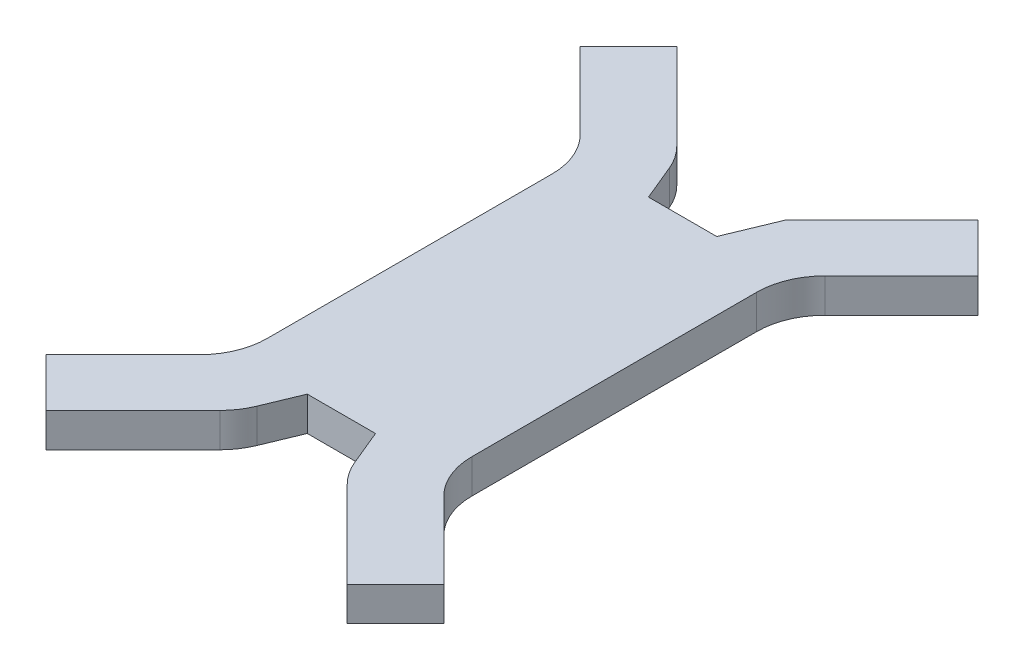
ISO-10303-21;
HEADER;
FILE_DESCRIPTION(('STEP AP214'),'2;1');
FILE_NAME('part.step','',(''),(''),'','','');
FILE_SCHEMA(('AUTOMOTIVE_DESIGN { 1 0 10303 214 1 1 1 1 }'));
ENDSEC;
DATA;
#1=APPLICATION_CONTEXT('core data for automotive mechanical design processes');
#2=APPLICATION_PROTOCOL_DEFINITION('international standard','automotive_design',2000,#1);
#3=PRODUCT_CONTEXT('',#1,'mechanical');
#4=PRODUCT('Part','Part','',(#3));
#5=PRODUCT_RELATED_PRODUCT_CATEGORY('part','',(#4));
#6=PRODUCT_DEFINITION_FORMATION('','',#4);
#7=PRODUCT_DEFINITION_CONTEXT('part definition',#1,'design');
#8=PRODUCT_DEFINITION('design','',#6,#7);
#9=PRODUCT_DEFINITION_SHAPE('','',#8);
#10=(LENGTH_UNIT() NAMED_UNIT(*) SI_UNIT(.MILLI.,.METRE.));
#11=(NAMED_UNIT(*) PLANE_ANGLE_UNIT() SI_UNIT($,.RADIAN.));
#12=(NAMED_UNIT(*) SI_UNIT($,.STERADIAN.) SOLID_ANGLE_UNIT());
#13=UNCERTAINTY_MEASURE_WITH_UNIT(LENGTH_MEASURE(1.E-05),#10,'distance_accuracy_value','');
#14=(GEOMETRIC_REPRESENTATION_CONTEXT(3) GLOBAL_UNCERTAINTY_ASSIGNED_CONTEXT((#13)) GLOBAL_UNIT_ASSIGNED_CONTEXT((#10,
#11,#12)) REPRESENTATION_CONTEXT('',''));
#15=CARTESIAN_POINT('',(0.,0.,0.));
#16=DIRECTION('',(0.,0.,1.));
#17=DIRECTION('',(1.,0.,0.));
#18=AXIS2_PLACEMENT_3D('',#15,#16,#17);
#19=CARTESIAN_POINT('',(-65.6077229732291,5.,-30.5840513108286));
#20=DIRECTION('',(0.707106781186548,0.,-0.707106781186548));
#21=DIRECTION('',(-0.707106781186548,0.,-0.707106781186548));
#22=AXIS2_PLACEMENT_3D('',#19,#20,#21);
#23=PLANE('',#22);
#24=DIRECTION('',(0.707106781186548,0.,0.707106781186548));
#25=VECTOR('',#24,1.);
#26=CARTESIAN_POINT('',(-65.6077229732291,0.,-30.5840513108286));
#27=LINE('',#26,#25);
#28=CARTESIAN_POINT('',(-65.6077229732291,0.,-30.5840513108286));
#29=VERTEX_POINT('',#28);
#30=CARTESIAN_POINT('',(-54.3945195376327,0.,-19.3708478752322));
#31=VERTEX_POINT('',#30);
#32=EDGE_CURVE('E243',#29,#31,#27,.T.);
#33=ORIENTED_EDGE('',*,*,#32,.T.);
#34=DIRECTION('',(0.,-1.,0.));
#35=VECTOR('',#34,1.);
#36=CARTESIAN_POINT('',(-54.3945195376327,5.,-19.3708478752322));
#37=LINE('',#36,#35);
#38=CARTESIAN_POINT('',(-54.3945195376327,5.,-19.3708478752322));
#39=VERTEX_POINT('',#38);
#40=EDGE_CURVE('E11',#39,#31,#37,.T.);
#41=ORIENTED_EDGE('',*,*,#40,.F.);
#42=DIRECTION('',(0.707106781186548,0.,0.707106781186548));
#43=VECTOR('',#42,1.);
#44=CARTESIAN_POINT('',(-65.6077229732291,5.,-30.5840513108286));
#45=LINE('',#44,#43);
#46=CARTESIAN_POINT('',(-65.6077229732291,5.,-30.5840513108286));
#47=VERTEX_POINT('',#46);
#48=EDGE_CURVE('E295',#47,#39,#45,.T.);
#49=ORIENTED_EDGE('',*,*,#48,.F.);
#50=DIRECTION('',(0.,-1.,0.));
#51=VECTOR('',#50,1.);
#52=CARTESIAN_POINT('',(-65.6077229732291,5.,-30.5840513108286));
#53=LINE('',#52,#51);
#54=EDGE_CURVE('E239',#47,#29,#53,.T.);
#55=ORIENTED_EDGE('',*,*,#54,.T.);
#56=EDGE_LOOP('',(#33,#41,#49,#55));
#57=FACE_BOUND('',#56,.T.);
#58=ADVANCED_FACE('F33',(#57),#23,.F.);
#59=CARTESIAN_POINT('',(-61.4655873494982,5.,-12.2997800633667));
#60=DIRECTION('',(0.,-1.,0.));
#61=DIRECTION('',(0.,0.,-1.));
#62=AXIS2_PLACEMENT_3D('',#59,#60,#61);
#63=CYLINDRICAL_SURFACE('',#62,10.);
#64=CARTESIAN_POINT('',(-61.4655873494982,0.,-12.2997800633667));
#65=DIRECTION('',(0.,-1.,0.));
#66=DIRECTION('',(0.,0.,-1.));
#67=AXIS2_PLACEMENT_3D('',#64,#65,#66);
#68=CIRCLE('',#67,10.);
#69=CARTESIAN_POINT('',(-51.4655873494982,0.,-12.2997800633667));
#70=VERTEX_POINT('',#69);
#71=EDGE_CURVE('E246',#31,#70,#68,.T.);
#72=ORIENTED_EDGE('',*,*,#71,.T.);
#73=DIRECTION('',(0.,-1.,0.));
#74=VECTOR('',#73,1.);
#75=CARTESIAN_POINT('',(-51.4655873494982,5.,-12.2997800633667));
#76=LINE('',#75,#74);
#77=CARTESIAN_POINT('',(-51.4655873494982,5.,-12.2997800633667));
#78=VERTEX_POINT('',#77);
#79=EDGE_CURVE('E41',#78,#70,#76,.T.);
#80=ORIENTED_EDGE('',*,*,#79,.F.);
#81=CARTESIAN_POINT('',(-61.4655873494982,5.,-12.2997800633667));
#82=DIRECTION('',(0.,-1.,0.));
#83=DIRECTION('',(0.,0.,-1.));
#84=AXIS2_PLACEMENT_3D('',#81,#82,#83);
#85=CIRCLE('',#84,10.);
#86=EDGE_CURVE('E149',#39,#78,#85,.T.);
#87=ORIENTED_EDGE('',*,*,#86,.F.);
#88=ORIENTED_EDGE('',*,*,#40,.T.);
#89=EDGE_LOOP('',(#72,#80,#87,#88));
#90=FACE_BOUND('',#89,.T.);
#91=ADVANCED_FACE('F448',(#90),#63,.F.);
#92=CARTESIAN_POINT('',(-51.4655873494982,5.,-12.2997800633667));
#93=DIRECTION('',(1.,0.,0.));
#94=DIRECTION('',(0.,0.,-1.));
#95=AXIS2_PLACEMENT_3D('',#92,#93,#94);
#96=PLANE('',#95);
#97=DIRECTION('',(0.,0.,1.));
#98=VECTOR('',#97,1.);
#99=CARTESIAN_POINT('',(-51.4655873494982,0.,-12.2997800633667));
#100=LINE('',#99,#98);
#101=CARTESIAN_POINT('',(-51.4655873494982,0.,29.4159486891714));
#102=VERTEX_POINT('',#101);
#103=EDGE_CURVE('E248',#70,#102,#100,.T.);
#104=ORIENTED_EDGE('',*,*,#103,.T.);
#105=DIRECTION('',(0.,-1.,0.));
#106=VECTOR('',#105,1.);
#107=CARTESIAN_POINT('',(-51.4655873494982,5.,29.4159486891714));
#108=LINE('',#107,#106);
#109=CARTESIAN_POINT('',(-51.4655873494982,5.,29.4159486891714));
#110=VERTEX_POINT('',#109);
#111=EDGE_CURVE('E359',#110,#102,#108,.T.);
#112=ORIENTED_EDGE('',*,*,#111,.F.);
#113=DIRECTION('',(0.,0.,1.));
#114=VECTOR('',#113,1.);
#115=CARTESIAN_POINT('',(-51.4655873494982,5.,-12.2997800633667));
#116=LINE('',#115,#114);
#117=EDGE_CURVE('E367',#78,#110,#116,.T.);
#118=ORIENTED_EDGE('',*,*,#117,.F.);
#119=ORIENTED_EDGE('',*,*,#79,.T.);
#120=EDGE_LOOP('',(#104,#112,#118,#119));
#121=FACE_BOUND('',#120,.T.);
#122=ADVANCED_FACE('F365',(#121),#96,.F.);
#123=CARTESIAN_POINT('',(-61.4655873494982,5.,29.4159486891714));
#124=DIRECTION('',(0.,-1.,0.));
#125=DIRECTION('',(0.,0.,-1.));
#126=AXIS2_PLACEMENT_3D('',#123,#124,#125);
#127=CYLINDRICAL_SURFACE('',#126,10.);
#128=CARTESIAN_POINT('',(-61.4655873494982,0.,29.4159486891714));
#129=DIRECTION('',(0.,-1.,0.));
#130=DIRECTION('',(0.,0.,-1.));
#131=AXIS2_PLACEMENT_3D('',#128,#129,#130);
#132=CIRCLE('',#131,10.);
#133=CARTESIAN_POINT('',(-54.3945195376327,0.,36.4870165010369));
#134=VERTEX_POINT('',#133);
#135=EDGE_CURVE('E250',#102,#134,#132,.T.);
#136=ORIENTED_EDGE('',*,*,#135,.T.);
#137=DIRECTION('',(0.,-1.,0.));
#138=VECTOR('',#137,1.);
#139=CARTESIAN_POINT('',(-54.3945195376327,5.,36.4870165010369));
#140=LINE('',#139,#138);
#141=CARTESIAN_POINT('',(-54.3945195376327,5.,36.4870165010369));
#142=VERTEX_POINT('',#141);
#143=EDGE_CURVE('E356',#142,#134,#140,.T.);
#144=ORIENTED_EDGE('',*,*,#143,.F.);
#145=CARTESIAN_POINT('',(-61.4655873494982,5.,29.4159486891714));
#146=DIRECTION('',(0.,-1.,0.));
#147=DIRECTION('',(0.,0.,-1.));
#148=AXIS2_PLACEMENT_3D('',#145,#146,#147);
#149=CIRCLE('',#148,10.);
#150=EDGE_CURVE('E385',#110,#142,#149,.T.);
#151=ORIENTED_EDGE('',*,*,#150,.F.);
#152=ORIENTED_EDGE('',*,*,#111,.T.);
#153=EDGE_LOOP('',(#136,#144,#151,#152));
#154=FACE_BOUND('',#153,.T.);
#155=ADVANCED_FACE('F376',(#154),#127,.F.);
#156=CARTESIAN_POINT('',(-54.3945195376327,5.,36.4870165010369));
#157=DIRECTION('',(0.707106781186547,0.,0.707106781186548));
#158=DIRECTION('',(0.707106781186548,0.,-0.707106781186547));
#159=AXIS2_PLACEMENT_3D('',#156,#157,#158);
#160=PLANE('',#159);
#161=DIRECTION('',(-0.707106781186548,0.,0.707106781186547));
#162=VECTOR('',#161,1.);
#163=CARTESIAN_POINT('',(-54.3945195376327,0.,36.4870165010369));
#164=LINE('',#163,#162);
#165=CARTESIAN_POINT('',(-65.6077229732291,0.,47.7002199366333));
#166=VERTEX_POINT('',#165);
#167=EDGE_CURVE('E252',#134,#166,#164,.T.);
#168=ORIENTED_EDGE('',*,*,#167,.T.);
#169=DIRECTION('',(0.,-1.,0.));
#170=VECTOR('',#169,1.);
#171=CARTESIAN_POINT('',(-65.6077229732291,5.,47.7002199366333));
#172=LINE('',#171,#170);
#173=CARTESIAN_POINT('',(-65.6077229732291,5.,47.7002199366333));
#174=VERTEX_POINT('',#173);
#175=EDGE_CURVE('E353',#174,#166,#172,.T.);
#176=ORIENTED_EDGE('',*,*,#175,.F.);
#177=DIRECTION('',(-0.707106781186548,0.,0.707106781186547));
#178=VECTOR('',#177,1.);
#179=CARTESIAN_POINT('',(-54.3945195376327,5.,36.4870165010369));
#180=LINE('',#179,#178);
#181=EDGE_CURVE('E382',#142,#174,#180,.T.);
#182=ORIENTED_EDGE('',*,*,#181,.F.);
#183=ORIENTED_EDGE('',*,*,#143,.T.);
#184=EDGE_LOOP('',(#168,#176,#182,#183));
#185=FACE_BOUND('',#184,.T.);
#186=ADVANCED_FACE('F380',(#185),#160,.F.);
#187=CARTESIAN_POINT('',(-65.6077229732291,5.,47.7002199366333));
#188=DIRECTION('',(0.707106781186548,0.,-0.707106781186548));
#189=DIRECTION('',(-0.707106781186548,0.,-0.707106781186548));
#190=AXIS2_PLACEMENT_3D('',#187,#188,#189);
#191=PLANE('',#190);
#192=DIRECTION('',(0.707106781186547,0.,0.707106781186547));
#193=VECTOR('',#192,1.);
#194=CARTESIAN_POINT('',(-65.6077229732291,0.,47.7002199366333));
#195=LINE('',#194,#193);
#196=CARTESIAN_POINT('',(-58.5366551613636,0.,54.7712877484988));
#197=VERTEX_POINT('',#196);
#198=EDGE_CURVE('E254',#166,#197,#195,.T.);
#199=ORIENTED_EDGE('',*,*,#198,.T.);
#200=DIRECTION('',(0.,-1.,0.));
#201=VECTOR('',#200,1.);
#202=CARTESIAN_POINT('',(-58.5366551613636,5.,54.7712877484988));
#203=LINE('',#202,#201);
#204=CARTESIAN_POINT('',(-58.5366551613636,5.,54.7712877484988));
#205=VERTEX_POINT('',#204);
#206=EDGE_CURVE('E350',#205,#197,#203,.T.);
#207=ORIENTED_EDGE('',*,*,#206,.F.);
#208=DIRECTION('',(0.707106781186547,0.,0.707106781186547));
#209=VECTOR('',#208,1.);
#210=CARTESIAN_POINT('',(-65.6077229732291,5.,47.7002199366333));
#211=LINE('',#210,#209);
#212=EDGE_CURVE('E384',#174,#205,#211,.T.);
#213=ORIENTED_EDGE('',*,*,#212,.F.);
#214=ORIENTED_EDGE('',*,*,#175,.T.);
#215=EDGE_LOOP('',(#199,#207,#213,#214));
#216=FACE_BOUND('',#215,.T.);
#217=ADVANCED_FACE('F461',(#216),#191,.F.);
#218=CARTESIAN_POINT('',(-58.5366551613636,5.,54.7712877484988));
#219=DIRECTION('',(-0.707106781186548,0.,-0.707106781186548));
#220=DIRECTION('',(-0.707106781186548,0.,0.707106781186548));
#221=AXIS2_PLACEMENT_3D('',#218,#219,#220);
#222=PLANE('',#221);
#223=DIRECTION('',(0.707106781186548,0.,-0.707106781186548));
#224=VECTOR('',#223,1.);
#225=CARTESIAN_POINT('',(-58.5366551613636,0.,54.7712877484988));
#226=LINE('',#225,#224);
#227=CARTESIAN_POINT('',(-45.801042375993,0.,42.0356749631281));
#228=VERTEX_POINT('',#227);
#229=EDGE_CURVE('E256',#197,#228,#226,.T.);
#230=ORIENTED_EDGE('',*,*,#229,.T.);
#231=DIRECTION('',(0.,-1.,0.));
#232=VECTOR('',#231,1.);
#233=CARTESIAN_POINT('',(-45.801042375993,5.,42.0356749631281));
#234=LINE('',#233,#232);
#235=CARTESIAN_POINT('',(-45.801042375993,5.,42.0356749631281));
#236=VERTEX_POINT('',#235);
#237=EDGE_CURVE('E347',#236,#228,#234,.T.);
#238=ORIENTED_EDGE('',*,*,#237,.F.);
#239=DIRECTION('',(0.707106781186548,0.,-0.707106781186548));
#240=VECTOR('',#239,1.);
#241=CARTESIAN_POINT('',(-58.5366551613636,5.,54.7712877484988));
#242=LINE('',#241,#240);
#243=EDGE_CURVE('E387',#205,#236,#242,.T.);
#244=ORIENTED_EDGE('',*,*,#243,.F.);
#245=ORIENTED_EDGE('',*,*,#206,.T.);
#246=EDGE_LOOP('',(#230,#238,#244,#245));
#247=FACE_BOUND('',#246,.T.);
#248=ADVANCED_FACE('F464',(#247),#222,.F.);
#249=CARTESIAN_POINT('',(-52.8721101878584,5.,34.9646071512626));
#250=DIRECTION('',(0.,-1.,0.));
#251=DIRECTION('',(0.,0.,-1.));
#252=AXIS2_PLACEMENT_3D('',#249,#250,#251);
#253=CYLINDRICAL_SURFACE('',#252,10.);
#254=CARTESIAN_POINT('',(-52.8721101878584,0.,34.9646071512626));
#255=DIRECTION('',(0.,1.,0.));
#256=DIRECTION('',(0.,0.,1.));
#257=AXIS2_PLACEMENT_3D('',#254,#255,#256);
#258=CIRCLE('',#257,10.);
#259=CARTESIAN_POINT('',(-43.6333148627455,0.,38.7914414749135));
#260=VERTEX_POINT('',#259);
#261=EDGE_CURVE('E258',#228,#260,#258,.T.);
#262=ORIENTED_EDGE('',*,*,#261,.T.);
#263=DIRECTION('',(0.,-1.,0.));
#264=VECTOR('',#263,1.);
#265=CARTESIAN_POINT('',(-43.6333148627455,5.,38.7914414749135));
#266=LINE('',#265,#264);
#267=CARTESIAN_POINT('',(-43.6333148627455,5.,38.7914414749135));
#268=VERTEX_POINT('',#267);
#269=EDGE_CURVE('E344',#268,#260,#266,.T.);
#270=ORIENTED_EDGE('',*,*,#269,.F.);
#271=CARTESIAN_POINT('',(-52.8721101878584,5.,34.9646071512626));
#272=DIRECTION('',(0.,1.,0.));
#273=DIRECTION('',(0.,0.,1.));
#274=AXIS2_PLACEMENT_3D('',#271,#272,#273);
#275=CIRCLE('',#274,10.);
#276=EDGE_CURVE('E393',#236,#268,#275,.T.);
#277=ORIENTED_EDGE('',*,*,#276,.F.);
#278=ORIENTED_EDGE('',*,*,#237,.T.);
#279=EDGE_LOOP('',(#262,#270,#277,#278));
#280=FACE_BOUND('',#279,.T.);
#281=ADVANCED_FACE('F468',(#280),#253,.T.);
#282=CARTESIAN_POINT('',(-41.4655873494982,5.,33.5580843129024));
#283=DIRECTION('',(-0.923879532511287,0.,-0.382683432365089));
#284=DIRECTION('',(-0.382683432365089,0.,0.923879532511287));
#285=AXIS2_PLACEMENT_3D('',#282,#283,#284);
#286=PLANE('',#285);
#287=DIRECTION('',(0.382683432365089,0.,-0.923879532511287));
#288=VECTOR('',#287,1.);
#289=CARTESIAN_POINT('',(-41.4655873494982,0.,33.5580843129024));
#290=LINE('',#289,#288);
#291=CARTESIAN_POINT('',(-41.4655873494982,0.,33.5580843129024));
#292=VERTEX_POINT('',#291);
#293=EDGE_CURVE('E260',#260,#292,#290,.T.);
#294=ORIENTED_EDGE('',*,*,#293,.T.);
#295=DIRECTION('',(0.,-1.,0.));
#296=VECTOR('',#295,1.);
#297=CARTESIAN_POINT('',(-41.4655873494982,5.,33.5580843129024));
#298=LINE('',#297,#296);
#299=CARTESIAN_POINT('',(-41.4655873494982,5.,33.5580843129024));
#300=VERTEX_POINT('',#299);
#301=EDGE_CURVE('E341',#300,#292,#298,.T.);
#302=ORIENTED_EDGE('',*,*,#301,.F.);
#303=DIRECTION('',(0.382683432365089,0.,-0.923879532511287));
#304=VECTOR('',#303,1.);
#305=CARTESIAN_POINT('',(-41.4655873494982,5.,33.5580843129024));
#306=LINE('',#305,#304);
#307=EDGE_CURVE('E395',#268,#300,#306,.T.);
#308=ORIENTED_EDGE('',*,*,#307,.F.);
#309=ORIENTED_EDGE('',*,*,#269,.T.);
#310=EDGE_LOOP('',(#294,#302,#308,#309));
#311=FACE_BOUND('',#310,.T.);
#312=ADVANCED_FACE('F472',(#311),#286,.F.);
#313=CARTESIAN_POINT('',(-41.4655873494982,5.,33.5580843129024));
#314=DIRECTION('',(0.,0.,-1.));
#315=DIRECTION('',(-1.,0.,0.));
#316=AXIS2_PLACEMENT_3D('',#313,#314,#315);
#317=PLANE('',#316);
#318=DIRECTION('',(1.,0.,0.));
#319=VECTOR('',#318,1.);
#320=CARTESIAN_POINT('',(-41.4655873494982,0.,33.5580843129024));
#321=LINE('',#320,#319);
#322=CARTESIAN_POINT('',(-31.4655873494982,0.,33.5580843129024));
#323=VERTEX_POINT('',#322);
#324=EDGE_CURVE('E262',#292,#323,#321,.T.);
#325=ORIENTED_EDGE('',*,*,#324,.T.);
#326=DIRECTION('',(0.,-1.,0.));
#327=VECTOR('',#326,1.);
#328=CARTESIAN_POINT('',(-31.4655873494982,5.,33.5580843129024));
#329=LINE('',#328,#327);
#330=CARTESIAN_POINT('',(-31.4655873494982,5.,33.5580843129024));
#331=VERTEX_POINT('',#330);
#332=EDGE_CURVE('E338',#331,#323,#329,.T.);
#333=ORIENTED_EDGE('',*,*,#332,.F.);
#334=DIRECTION('',(1.,0.,0.));
#335=VECTOR('',#334,1.);
#336=CARTESIAN_POINT('',(-41.4655873494982,5.,33.5580843129024));
#337=LINE('',#336,#335);
#338=EDGE_CURVE('E397',#300,#331,#337,.T.);
#339=ORIENTED_EDGE('',*,*,#338,.F.);
#340=ORIENTED_EDGE('',*,*,#301,.T.);
#341=EDGE_LOOP('',(#325,#333,#339,#340));
#342=FACE_BOUND('',#341,.T.);
#343=ADVANCED_FACE('F476',(#342),#317,.F.);
#344=CARTESIAN_POINT('',(-31.4655873494982,5.,33.5580843129024));
#345=DIRECTION('',(0.923879532511287,0.,-0.38268343236509));
#346=DIRECTION('',(-0.38268343236509,0.,-0.923879532511287));
#347=AXIS2_PLACEMENT_3D('',#344,#345,#346);
#348=PLANE('',#347);
#349=DIRECTION('',(0.38268343236509,0.,0.923879532511287));
#350=VECTOR('',#349,1.);
#351=CARTESIAN_POINT('',(-31.4655873494982,0.,33.5580843129024));
#352=LINE('',#351,#350);
#353=CARTESIAN_POINT('',(-29.2978598362508,0.,38.7914414749135));
#354=VERTEX_POINT('',#353);
#355=EDGE_CURVE('E264',#323,#354,#352,.T.);
#356=ORIENTED_EDGE('',*,*,#355,.T.);
#357=DIRECTION('',(0.,-1.,0.));
#358=VECTOR('',#357,1.);
#359=CARTESIAN_POINT('',(-29.2978598362508,5.,38.7914414749135));
#360=LINE('',#359,#358);
#361=CARTESIAN_POINT('',(-29.2978598362508,5.,38.7914414749135));
#362=VERTEX_POINT('',#361);
#363=EDGE_CURVE('E335',#362,#354,#360,.T.);
#364=ORIENTED_EDGE('',*,*,#363,.F.);
#365=DIRECTION('',(0.38268343236509,0.,0.923879532511287));
#366=VECTOR('',#365,1.);
#367=CARTESIAN_POINT('',(-31.4655873494982,5.,33.5580843129024));
#368=LINE('',#367,#366);
#369=EDGE_CURVE('E399',#331,#362,#368,.T.);
#370=ORIENTED_EDGE('',*,*,#369,.F.);
#371=ORIENTED_EDGE('',*,*,#332,.T.);
#372=EDGE_LOOP('',(#356,#364,#370,#371));
#373=FACE_BOUND('',#372,.T.);
#374=ADVANCED_FACE('F480',(#373),#348,.F.);
#375=CARTESIAN_POINT('',(-20.0590645111379,5.,34.9646071512626));
#376=DIRECTION('',(0.,-1.,0.));
#377=DIRECTION('',(0.,0.,-1.));
#378=AXIS2_PLACEMENT_3D('',#375,#376,#377);
#379=CYLINDRICAL_SURFACE('',#378,10.);
#380=CARTESIAN_POINT('',(-20.0590645111379,0.,34.9646071512626));
#381=DIRECTION('',(0.,1.,0.));
#382=DIRECTION('',(0.,0.,1.));
#383=AXIS2_PLACEMENT_3D('',#380,#381,#382);
#384=CIRCLE('',#383,10.);
#385=CARTESIAN_POINT('',(-27.1301323230034,0.,42.0356749631281));
#386=VERTEX_POINT('',#385);
#387=EDGE_CURVE('E266',#354,#386,#384,.T.);
#388=ORIENTED_EDGE('',*,*,#387,.T.);
#389=DIRECTION('',(0.,-1.,0.));
#390=VECTOR('',#389,1.);
#391=CARTESIAN_POINT('',(-27.1301323230034,5.,42.0356749631281));
#392=LINE('',#391,#390);
#393=CARTESIAN_POINT('',(-27.1301323230034,5.,42.0356749631281));
#394=VERTEX_POINT('',#393);
#395=EDGE_CURVE('E332',#394,#386,#392,.T.);
#396=ORIENTED_EDGE('',*,*,#395,.F.);
#397=CARTESIAN_POINT('',(-20.0590645111379,5.,34.9646071512626));
#398=DIRECTION('',(0.,1.,0.));
#399=DIRECTION('',(0.,0.,1.));
#400=AXIS2_PLACEMENT_3D('',#397,#398,#399);
#401=CIRCLE('',#400,10.);
#402=EDGE_CURVE('E401',#362,#394,#401,.T.);
#403=ORIENTED_EDGE('',*,*,#402,.F.);
#404=ORIENTED_EDGE('',*,*,#363,.T.);
#405=EDGE_LOOP('',(#388,#396,#403,#404));
#406=FACE_BOUND('',#405,.T.);
#407=ADVANCED_FACE('F484',(#406),#379,.T.);
#408=CARTESIAN_POINT('',(-14.3945195376327,5.,54.7712877484988));
#409=DIRECTION('',(0.707106781186548,0.,-0.707106781186547));
#410=DIRECTION('',(-0.707106781186547,0.,-0.707106781186548));
#411=AXIS2_PLACEMENT_3D('',#408,#409,#410);
#412=PLANE('',#411);
#413=DIRECTION('',(0.707106781186547,0.,0.707106781186548));
#414=VECTOR('',#413,1.);
#415=CARTESIAN_POINT('',(-14.3945195376327,0.,54.7712877484988));
#416=LINE('',#415,#414);
#417=CARTESIAN_POINT('',(-14.3945195376327,0.,54.7712877484988));
#418=VERTEX_POINT('',#417);
#419=EDGE_CURVE('E268',#386,#418,#416,.T.);
#420=ORIENTED_EDGE('',*,*,#419,.T.);
#421=DIRECTION('',(0.,-1.,0.));
#422=VECTOR('',#421,1.);
#423=CARTESIAN_POINT('',(-14.3945195376327,5.,54.7712877484988));
#424=LINE('',#423,#422);
#425=CARTESIAN_POINT('',(-14.3945195376327,5.,54.7712877484988));
#426=VERTEX_POINT('',#425);
#427=EDGE_CURVE('E329',#426,#418,#424,.T.);
#428=ORIENTED_EDGE('',*,*,#427,.F.);
#429=DIRECTION('',(0.707106781186547,0.,0.707106781186548));
#430=VECTOR('',#429,1.);
#431=CARTESIAN_POINT('',(-14.3945195376327,5.,54.7712877484988));
#432=LINE('',#431,#430);
#433=EDGE_CURVE('E403',#394,#426,#432,.T.);
#434=ORIENTED_EDGE('',*,*,#433,.F.);
#435=ORIENTED_EDGE('',*,*,#395,.T.);
#436=EDGE_LOOP('',(#420,#428,#434,#435));
#437=FACE_BOUND('',#436,.T.);
#438=ADVANCED_FACE('F488',(#437),#412,.F.);
#439=CARTESIAN_POINT('',(-7.32345172576723,5.,47.7002199366333));
#440=DIRECTION('',(-0.707106781186548,0.,-0.707106781186548));
#441=DIRECTION('',(-0.707106781186548,0.,0.707106781186548));
#442=AXIS2_PLACEMENT_3D('',#439,#440,#441);
#443=PLANE('',#442);
#444=DIRECTION('',(0.707106781186547,0.,-0.707106781186547));
#445=VECTOR('',#444,1.);
#446=CARTESIAN_POINT('',(-7.32345172576723,0.,47.7002199366333));
#447=LINE('',#446,#445);
#448=CARTESIAN_POINT('',(-7.32345172576723,0.,47.7002199366333));
#449=VERTEX_POINT('',#448);
#450=EDGE_CURVE('E270',#418,#449,#447,.T.);
#451=ORIENTED_EDGE('',*,*,#450,.T.);
#452=DIRECTION('',(0.,-1.,0.));
#453=VECTOR('',#452,1.);
#454=CARTESIAN_POINT('',(-7.32345172576723,5.,47.7002199366333));
#455=LINE('',#454,#453);
#456=CARTESIAN_POINT('',(-7.32345172576723,5.,47.7002199366333));
#457=VERTEX_POINT('',#456);
#458=EDGE_CURVE('E326',#457,#449,#455,.T.);
#459=ORIENTED_EDGE('',*,*,#458,.F.);
#460=DIRECTION('',(0.707106781186547,0.,-0.707106781186547));
#461=VECTOR('',#460,1.);
#462=CARTESIAN_POINT('',(-7.32345172576723,5.,47.7002199366333));
#463=LINE('',#462,#461);
#464=EDGE_CURVE('E405',#426,#457,#463,.T.);
#465=ORIENTED_EDGE('',*,*,#464,.F.);
#466=ORIENTED_EDGE('',*,*,#427,.T.);
#467=EDGE_LOOP('',(#451,#459,#465,#466));
#468=FACE_BOUND('',#467,.T.);
#469=ADVANCED_FACE('F492',(#468),#443,.F.);
#470=CARTESIAN_POINT('',(-18.5366551613636,5.,36.4870165010369));
#471=DIRECTION('',(-0.707106781186547,0.,0.707106781186548));
#472=DIRECTION('',(0.707106781186548,0.,0.707106781186547));
#473=AXIS2_PLACEMENT_3D('',#470,#471,#472);
#474=PLANE('',#473);
#475=DIRECTION('',(-0.707106781186548,0.,-0.707106781186547));
#476=VECTOR('',#475,1.);
#477=CARTESIAN_POINT('',(-18.5366551613636,0.,36.4870165010369));
#478=LINE('',#477,#476);
#479=CARTESIAN_POINT('',(-18.5366551613636,0.,36.4870165010369));
#480=VERTEX_POINT('',#479);
#481=EDGE_CURVE('E272',#449,#480,#478,.T.);
#482=ORIENTED_EDGE('',*,*,#481,.T.);
#483=DIRECTION('',(0.,-1.,0.));
#484=VECTOR('',#483,1.);
#485=CARTESIAN_POINT('',(-18.5366551613636,5.,36.4870165010369));
#486=LINE('',#485,#484);
#487=CARTESIAN_POINT('',(-18.5366551613636,5.,36.4870165010369));
#488=VERTEX_POINT('',#487);
#489=EDGE_CURVE('E323',#488,#480,#486,.T.);
#490=ORIENTED_EDGE('',*,*,#489,.F.);
#491=DIRECTION('',(-0.707106781186548,0.,-0.707106781186547));
#492=VECTOR('',#491,1.);
#493=CARTESIAN_POINT('',(-18.5366551613636,5.,36.4870165010369));
#494=LINE('',#493,#492);
#495=EDGE_CURVE('E407',#457,#488,#494,.T.);
#496=ORIENTED_EDGE('',*,*,#495,.F.);
#497=ORIENTED_EDGE('',*,*,#458,.T.);
#498=EDGE_LOOP('',(#482,#490,#496,#497));
#499=FACE_BOUND('',#498,.T.);
#500=ADVANCED_FACE('F496',(#499),#474,.F.);
#501=CARTESIAN_POINT('',(-11.4655873494982,5.,29.4159486891714));
#502=DIRECTION('',(0.,-1.,0.));
#503=DIRECTION('',(0.,0.,-1.));
#504=AXIS2_PLACEMENT_3D('',#501,#502,#503);
#505=CYLINDRICAL_SURFACE('',#504,10.);
#506=CARTESIAN_POINT('',(-11.4655873494982,0.,29.4159486891714));
#507=DIRECTION('',(0.,-1.,0.));
#508=DIRECTION('',(0.,0.,-1.));
#509=AXIS2_PLACEMENT_3D('',#506,#507,#508);
#510=CIRCLE('',#509,10.);
#511=CARTESIAN_POINT('',(-21.4655873494982,0.,29.4159486891714));
#512=VERTEX_POINT('',#511);
#513=EDGE_CURVE('E274',#480,#512,#510,.T.);
#514=ORIENTED_EDGE('',*,*,#513,.T.);
#515=DIRECTION('',(0.,-1.,0.));
#516=VECTOR('',#515,1.);
#517=CARTESIAN_POINT('',(-21.4655873494982,5.,29.4159486891714));
#518=LINE('',#517,#516);
#519=CARTESIAN_POINT('',(-21.4655873494982,5.,29.4159486891714));
#520=VERTEX_POINT('',#519);
#521=EDGE_CURVE('E320',#520,#512,#518,.T.);
#522=ORIENTED_EDGE('',*,*,#521,.F.);
#523=CARTESIAN_POINT('',(-11.4655873494982,5.,29.4159486891714));
#524=DIRECTION('',(0.,-1.,0.));
#525=DIRECTION('',(0.,0.,-1.));
#526=AXIS2_PLACEMENT_3D('',#523,#524,#525);
#527=CIRCLE('',#526,10.);
#528=EDGE_CURVE('E409',#488,#520,#527,.T.);
#529=ORIENTED_EDGE('',*,*,#528,.F.);
#530=ORIENTED_EDGE('',*,*,#489,.T.);
#531=EDGE_LOOP('',(#514,#522,#529,#530));
#532=FACE_BOUND('',#531,.T.);
#533=ADVANCED_FACE('F500',(#532),#505,.F.);
#534=CARTESIAN_POINT('',(-21.4655873494982,5.,-12.2997800633667));
#535=DIRECTION('',(-1.,0.,0.));
#536=DIRECTION('',(0.,0.,1.));
#537=AXIS2_PLACEMENT_3D('',#534,#535,#536);
#538=PLANE('',#537);
#539=DIRECTION('',(0.,0.,-1.));
#540=VECTOR('',#539,1.);
#541=CARTESIAN_POINT('',(-21.4655873494982,0.,-12.2997800633667));
#542=LINE('',#541,#540);
#543=CARTESIAN_POINT('',(-21.4655873494982,0.,-12.2997800633667));
#544=VERTEX_POINT('',#543);
#545=EDGE_CURVE('E276',#512,#544,#542,.T.);
#546=ORIENTED_EDGE('',*,*,#545,.T.);
#547=DIRECTION('',(0.,-1.,0.));
#548=VECTOR('',#547,1.);
#549=CARTESIAN_POINT('',(-21.4655873494982,5.,-12.2997800633667));
#550=LINE('',#549,#548);
#551=CARTESIAN_POINT('',(-21.4655873494982,5.,-12.2997800633667));
#552=VERTEX_POINT('',#551);
#553=EDGE_CURVE('E317',#552,#544,#550,.T.);
#554=ORIENTED_EDGE('',*,*,#553,.F.);
#555=DIRECTION('',(0.,0.,-1.));
#556=VECTOR('',#555,1.);
#557=CARTESIAN_POINT('',(-21.4655873494982,5.,-12.2997800633667));
#558=LINE('',#557,#556);
#559=EDGE_CURVE('E411',#520,#552,#558,.T.);
#560=ORIENTED_EDGE('',*,*,#559,.F.);
#561=ORIENTED_EDGE('',*,*,#521,.T.);
#562=EDGE_LOOP('',(#546,#554,#560,#561));
#563=FACE_BOUND('',#562,.T.);
#564=ADVANCED_FACE('F504',(#563),#538,.F.);
#565=CARTESIAN_POINT('',(-11.4655873494982,5.,-12.2997800633667));
#566=DIRECTION('',(0.,-1.,0.));
#567=DIRECTION('',(0.,0.,-1.));
#568=AXIS2_PLACEMENT_3D('',#565,#566,#567);
#569=CYLINDRICAL_SURFACE('',#568,10.);
#570=CARTESIAN_POINT('',(-11.4655873494982,0.,-12.2997800633667));
#571=DIRECTION('',(0.,-1.,0.));
#572=DIRECTION('',(0.,0.,-1.));
#573=AXIS2_PLACEMENT_3D('',#570,#571,#572);
#574=CIRCLE('',#573,10.);
#575=CARTESIAN_POINT('',(-18.5366551613636,0.,-19.3708478752322));
#576=VERTEX_POINT('',#575);
#577=EDGE_CURVE('E278',#544,#576,#574,.T.);
#578=ORIENTED_EDGE('',*,*,#577,.T.);
#579=DIRECTION('',(0.,-1.,0.));
#580=VECTOR('',#579,1.);
#581=CARTESIAN_POINT('',(-18.5366551613636,5.,-19.3708478752322));
#582=LINE('',#581,#580);
#583=CARTESIAN_POINT('',(-18.5366551613636,5.,-19.3708478752322));
#584=VERTEX_POINT('',#583);
#585=EDGE_CURVE('E314',#584,#576,#582,.T.);
#586=ORIENTED_EDGE('',*,*,#585,.F.);
#587=CARTESIAN_POINT('',(-11.4655873494982,5.,-12.2997800633667));
#588=DIRECTION('',(0.,-1.,0.));
#589=DIRECTION('',(0.,0.,-1.));
#590=AXIS2_PLACEMENT_3D('',#587,#588,#589);
#591=CIRCLE('',#590,10.);
#592=EDGE_CURVE('E413',#552,#584,#591,.T.);
#593=ORIENTED_EDGE('',*,*,#592,.F.);
#594=ORIENTED_EDGE('',*,*,#553,.T.);
#595=EDGE_LOOP('',(#578,#586,#593,#594));
#596=FACE_BOUND('',#595,.T.);
#597=ADVANCED_FACE('F508',(#596),#569,.F.);
#598=CARTESIAN_POINT('',(-7.32345172576723,5.,-30.5840513108286));
#599=DIRECTION('',(-0.707106781186548,0.,-0.707106781186548));
#600=DIRECTION('',(-0.707106781186548,0.,0.707106781186548));
#601=AXIS2_PLACEMENT_3D('',#598,#599,#600);
#602=PLANE('',#601);
#603=DIRECTION('',(0.707106781186548,0.,-0.707106781186548));
#604=VECTOR('',#603,1.);
#605=CARTESIAN_POINT('',(-7.32345172576723,0.,-30.5840513108286));
#606=LINE('',#605,#604);
#607=CARTESIAN_POINT('',(-7.32345172576723,0.,-30.5840513108286));
#608=VERTEX_POINT('',#607);
#609=EDGE_CURVE('E280',#576,#608,#606,.T.);
#610=ORIENTED_EDGE('',*,*,#609,.T.);
#611=DIRECTION('',(0.,-1.,0.));
#612=VECTOR('',#611,1.);
#613=CARTESIAN_POINT('',(-7.32345172576723,5.,-30.5840513108286));
#614=LINE('',#613,#612);
#615=CARTESIAN_POINT('',(-7.32345172576723,5.,-30.5840513108286));
#616=VERTEX_POINT('',#615);
#617=EDGE_CURVE('E311',#616,#608,#614,.T.);
#618=ORIENTED_EDGE('',*,*,#617,.F.);
#619=DIRECTION('',(0.707106781186548,0.,-0.707106781186548));
#620=VECTOR('',#619,1.);
#621=CARTESIAN_POINT('',(-7.32345172576723,5.,-30.5840513108286));
#622=LINE('',#621,#620);
#623=EDGE_CURVE('E415',#584,#616,#622,.T.);
#624=ORIENTED_EDGE('',*,*,#623,.F.);
#625=ORIENTED_EDGE('',*,*,#585,.T.);
#626=EDGE_LOOP('',(#610,#618,#624,#625));
#627=FACE_BOUND('',#626,.T.);
#628=ADVANCED_FACE('F512',(#627),#602,.F.);
#629=CARTESIAN_POINT('',(-7.32345172576723,5.,-30.5840513108286));
#630=DIRECTION('',(-0.707106781186548,0.,0.707106781186547));
#631=DIRECTION('',(0.707106781186547,0.,0.707106781186548));
#632=AXIS2_PLACEMENT_3D('',#629,#630,#631);
#633=PLANE('',#632);
#634=DIRECTION('',(-0.707106781186547,0.,-0.707106781186548));
#635=VECTOR('',#634,1.);
#636=CARTESIAN_POINT('',(-7.32345172576723,0.,-30.5840513108286));
#637=LINE('',#636,#635);
#638=CARTESIAN_POINT('',(-14.3945195376327,0.,-37.6551191226941));
#639=VERTEX_POINT('',#638);
#640=EDGE_CURVE('E282',#608,#639,#637,.T.);
#641=ORIENTED_EDGE('',*,*,#640,.T.);
#642=DIRECTION('',(0.,-1.,0.));
#643=VECTOR('',#642,1.);
#644=CARTESIAN_POINT('',(-14.3945195376327,5.,-37.6551191226941));
#645=LINE('',#644,#643);
#646=CARTESIAN_POINT('',(-14.3945195376327,5.,-37.6551191226941));
#647=VERTEX_POINT('',#646);
#648=EDGE_CURVE('E308',#647,#639,#645,.T.);
#649=ORIENTED_EDGE('',*,*,#648,.F.);
#650=DIRECTION('',(-0.707106781186547,0.,-0.707106781186548));
#651=VECTOR('',#650,1.);
#652=CARTESIAN_POINT('',(-7.32345172576723,5.,-30.5840513108286));
#653=LINE('',#652,#651);
#654=EDGE_CURVE('E417',#616,#647,#653,.T.);
#655=ORIENTED_EDGE('',*,*,#654,.F.);
#656=ORIENTED_EDGE('',*,*,#617,.T.);
#657=EDGE_LOOP('',(#641,#649,#655,#656));
#658=FACE_BOUND('',#657,.T.);
#659=ADVANCED_FACE('F516',(#658),#633,.F.);
#660=CARTESIAN_POINT('',(-14.3945195376327,5.,-37.6551191226941));
#661=DIRECTION('',(0.707106781186548,0.,0.707106781186548));
#662=DIRECTION('',(0.707106781186548,0.,-0.707106781186548));
#663=AXIS2_PLACEMENT_3D('',#660,#661,#662);
#664=PLANE('',#663);
#665=DIRECTION('',(-0.707106781186547,0.,0.707106781186547));
#666=VECTOR('',#665,1.);
#667=CARTESIAN_POINT('',(-14.3945195376327,0.,-37.6551191226941));
#668=LINE('',#667,#666);
#669=CARTESIAN_POINT('',(-28.5366551613637,0.,-23.5129834989631));
#670=VERTEX_POINT('',#669);
#671=EDGE_CURVE('E284',#639,#670,#668,.T.);
#672=ORIENTED_EDGE('',*,*,#671,.T.);
#673=DIRECTION('',(0.,-1.,0.));
#674=VECTOR('',#673,1.);
#675=CARTESIAN_POINT('',(-28.5366551613637,5.,-23.5129834989631));
#676=LINE('',#675,#674);
#677=CARTESIAN_POINT('',(-28.5366551613637,5.,-23.5129834989631));
#678=VERTEX_POINT('',#677);
#679=EDGE_CURVE('E305',#678,#670,#676,.T.);
#680=ORIENTED_EDGE('',*,*,#679,.F.);
#681=DIRECTION('',(-0.707106781186547,0.,0.707106781186547));
#682=VECTOR('',#681,1.);
#683=CARTESIAN_POINT('',(-14.3945195376327,5.,-37.6551191226941));
#684=LINE('',#683,#682);
#685=EDGE_CURVE('E419',#647,#678,#684,.T.);
#686=ORIENTED_EDGE('',*,*,#685,.F.);
#687=ORIENTED_EDGE('',*,*,#648,.T.);
#688=EDGE_LOOP('',(#672,#680,#686,#687));
#689=FACE_BOUND('',#688,.T.);
#690=ADVANCED_FACE('F520',(#689),#664,.F.);
#691=CARTESIAN_POINT('',(-31.4655873494982,5.,-16.4419156870977));
#692=DIRECTION('',(0.923879532511287,0.,0.38268343236509));
#693=DIRECTION('',(0.38268343236509,0.,-0.923879532511287));
#694=AXIS2_PLACEMENT_3D('',#691,#692,#693);
#695=PLANE('',#694);
#696=DIRECTION('',(-0.38268343236509,0.,0.923879532511287));
#697=VECTOR('',#696,1.);
#698=CARTESIAN_POINT('',(-31.4655873494982,0.,-16.4419156870977));
#699=LINE('',#698,#697);
#700=CARTESIAN_POINT('',(-31.4655873494982,0.,-16.4419156870977));
#701=VERTEX_POINT('',#700);
#702=EDGE_CURVE('E286',#670,#701,#699,.T.);
#703=ORIENTED_EDGE('',*,*,#702,.T.);
#704=DIRECTION('',(0.,-1.,0.));
#705=VECTOR('',#704,1.);
#706=CARTESIAN_POINT('',(-31.4655873494982,5.,-16.4419156870977));
#707=LINE('',#706,#705);
#708=CARTESIAN_POINT('',(-31.4655873494982,5.,-16.4419156870977));
#709=VERTEX_POINT('',#708);
#710=EDGE_CURVE('E302',#709,#701,#707,.T.);
#711=ORIENTED_EDGE('',*,*,#710,.F.);
#712=DIRECTION('',(-0.38268343236509,0.,0.923879532511287));
#713=VECTOR('',#712,1.);
#714=CARTESIAN_POINT('',(-31.4655873494982,5.,-16.4419156870977));
#715=LINE('',#714,#713);
#716=EDGE_CURVE('E421',#678,#709,#715,.T.);
#717=ORIENTED_EDGE('',*,*,#716,.F.);
#718=ORIENTED_EDGE('',*,*,#679,.T.);
#719=EDGE_LOOP('',(#703,#711,#717,#718));
#720=FACE_BOUND('',#719,.T.);
#721=ADVANCED_FACE('F524',(#720),#695,.F.);
#722=CARTESIAN_POINT('',(-41.4655873494982,5.,-16.4419156870977));
#723=DIRECTION('',(0.,0.,1.));
#724=DIRECTION('',(1.,0.,0.));
#725=AXIS2_PLACEMENT_3D('',#722,#723,#724);
#726=PLANE('',#725);
#727=DIRECTION('',(-1.,0.,0.));
#728=VECTOR('',#727,1.);
#729=CARTESIAN_POINT('',(-41.4655873494982,0.,-16.4419156870977));
#730=LINE('',#729,#728);
#731=CARTESIAN_POINT('',(-41.4655873494982,0.,-16.4419156870977));
#732=VERTEX_POINT('',#731);
#733=EDGE_CURVE('E288',#701,#732,#730,.T.);
#734=ORIENTED_EDGE('',*,*,#733,.T.);
#735=DIRECTION('',(0.,-1.,0.));
#736=VECTOR('',#735,1.);
#737=CARTESIAN_POINT('',(-41.4655873494982,5.,-16.4419156870977));
#738=LINE('',#737,#736);
#739=CARTESIAN_POINT('',(-41.4655873494982,5.,-16.4419156870977));
#740=VERTEX_POINT('',#739);
#741=EDGE_CURVE('E299',#740,#732,#738,.T.);
#742=ORIENTED_EDGE('',*,*,#741,.F.);
#743=DIRECTION('',(-1.,0.,0.));
#744=VECTOR('',#743,1.);
#745=CARTESIAN_POINT('',(-41.4655873494982,5.,-16.4419156870977));
#746=LINE('',#745,#744);
#747=EDGE_CURVE('E423',#709,#740,#746,.T.);
#748=ORIENTED_EDGE('',*,*,#747,.F.);
#749=ORIENTED_EDGE('',*,*,#710,.T.);
#750=EDGE_LOOP('',(#734,#742,#748,#749));
#751=FACE_BOUND('',#750,.T.);
#752=ADVANCED_FACE('F429',(#751),#726,.F.);
#753=CARTESIAN_POINT('',(-41.4655873494982,5.,-16.4419156870977));
#754=DIRECTION('',(-0.923879532511287,0.,0.382683432365089));
#755=DIRECTION('',(0.382683432365089,0.,0.923879532511287));
#756=AXIS2_PLACEMENT_3D('',#753,#754,#755);
#757=PLANE('',#756);
#758=DIRECTION('',(-0.382683432365089,0.,-0.923879532511287));
#759=VECTOR('',#758,1.);
#760=CARTESIAN_POINT('',(-41.4655873494982,0.,-16.4419156870977));
#761=LINE('',#760,#759);
#762=CARTESIAN_POINT('',(-43.6333148627455,0.,-21.6752728491088));
#763=VERTEX_POINT('',#762);
#764=EDGE_CURVE('E290',#732,#763,#761,.T.);
#765=ORIENTED_EDGE('',*,*,#764,.T.);
#766=DIRECTION('',(0.,-1.,0.));
#767=VECTOR('',#766,1.);
#768=CARTESIAN_POINT('',(-43.6333148627455,5.,-21.6752728491088));
#769=LINE('',#768,#767);
#770=CARTESIAN_POINT('',(-43.6333148627455,5.,-21.6752728491088));
#771=VERTEX_POINT('',#770);
#772=EDGE_CURVE('E234',#771,#763,#769,.T.);
#773=ORIENTED_EDGE('',*,*,#772,.F.);
#774=DIRECTION('',(-0.382683432365089,0.,-0.923879532511287));
#775=VECTOR('',#774,1.);
#776=CARTESIAN_POINT('',(-41.4655873494982,5.,-16.4419156870977));
#777=LINE('',#776,#775);
#778=EDGE_CURVE('E225',#740,#771,#777,.T.);
#779=ORIENTED_EDGE('',*,*,#778,.F.);
#780=ORIENTED_EDGE('',*,*,#741,.T.);
#781=EDGE_LOOP('',(#765,#773,#779,#780));
#782=FACE_BOUND('',#781,.T.);
#783=ADVANCED_FACE('F433',(#782),#757,.F.);
#784=CARTESIAN_POINT('',(-52.8721101878584,5.,-17.8484385254579));
#785=DIRECTION('',(0.,-1.,0.));
#786=DIRECTION('',(0.,0.,-1.));
#787=AXIS2_PLACEMENT_3D('',#784,#785,#786);
#788=CYLINDRICAL_SURFACE('',#787,10.);
#789=CARTESIAN_POINT('',(-52.8721101878584,0.,-17.8484385254579));
#790=DIRECTION('',(0.,1.,0.));
#791=DIRECTION('',(0.,0.,-1.));
#792=AXIS2_PLACEMENT_3D('',#789,#790,#791);
#793=CIRCLE('',#792,10.);
#794=CARTESIAN_POINT('',(-45.801042375993,0.,-24.9195063373234));
#795=VERTEX_POINT('',#794);
#796=EDGE_CURVE('E233',#763,#795,#793,.T.);
#797=ORIENTED_EDGE('',*,*,#796,.T.);
#798=DIRECTION('',(0.,-1.,0.));
#799=VECTOR('',#798,1.);
#800=CARTESIAN_POINT('',(-45.801042375993,5.,-24.9195063373234));
#801=LINE('',#800,#799);
#802=CARTESIAN_POINT('',(-45.801042375993,5.,-24.9195063373234));
#803=VERTEX_POINT('',#802);
#804=EDGE_CURVE('E230',#803,#795,#801,.T.);
#805=ORIENTED_EDGE('',*,*,#804,.F.);
#806=CARTESIAN_POINT('',(-52.8721101878584,5.,-17.8484385254579));
#807=DIRECTION('',(0.,1.,0.));
#808=DIRECTION('',(0.,0.,-1.));
#809=AXIS2_PLACEMENT_3D('',#806,#807,#808);
#810=CIRCLE('',#809,10.);
#811=EDGE_CURVE('E219',#771,#803,#810,.T.);
#812=ORIENTED_EDGE('',*,*,#811,.F.);
#813=ORIENTED_EDGE('',*,*,#772,.T.);
#814=EDGE_LOOP('',(#797,#805,#812,#813));
#815=FACE_BOUND('',#814,.T.);
#816=ADVANCED_FACE('F231',(#815),#788,.T.);
#817=CARTESIAN_POINT('',(-58.5366551613636,5.,-37.6551191226941));
#818=DIRECTION('',(-0.707106781186547,0.,0.707106781186548));
#819=DIRECTION('',(0.707106781186548,0.,0.707106781186547));
#820=AXIS2_PLACEMENT_3D('',#817,#818,#819);
#821=PLANE('',#820);
#822=DIRECTION('',(-0.707106781186548,0.,-0.707106781186547));
#823=VECTOR('',#822,1.);
#824=CARTESIAN_POINT('',(-58.5366551613636,0.,-37.6551191226941));
#825=LINE('',#824,#823);
#826=CARTESIAN_POINT('',(-58.5366551613636,0.,-37.6551191226941));
#827=VERTEX_POINT('',#826);
#828=EDGE_CURVE('E135',#795,#827,#825,.T.);
#829=ORIENTED_EDGE('',*,*,#828,.T.);
#830=DIRECTION('',(0.,-1.,0.));
#831=VECTOR('',#830,1.);
#832=CARTESIAN_POINT('',(-58.5366551613636,5.,-37.6551191226941));
#833=LINE('',#832,#831);
#834=CARTESIAN_POINT('',(-58.5366551613636,5.,-37.6551191226941));
#835=VERTEX_POINT('',#834);
#836=EDGE_CURVE('E235',#835,#827,#833,.T.);
#837=ORIENTED_EDGE('',*,*,#836,.F.);
#838=DIRECTION('',(-0.707106781186548,0.,-0.707106781186547));
#839=VECTOR('',#838,1.);
#840=CARTESIAN_POINT('',(-58.5366551613636,5.,-37.6551191226941));
#841=LINE('',#840,#839);
#842=EDGE_CURVE('E223',#803,#835,#841,.T.);
#843=ORIENTED_EDGE('',*,*,#842,.F.);
#844=ORIENTED_EDGE('',*,*,#804,.T.);
#845=EDGE_LOOP('',(#829,#837,#843,#844));
#846=FACE_BOUND('',#845,.T.);
#847=ADVANCED_FACE('F237',(#846),#821,.F.);
#848=CARTESIAN_POINT('',(-65.6077229732291,5.,-30.5840513108286));
#849=DIRECTION('',(0.707106781186548,0.,0.707106781186548));
#850=DIRECTION('',(0.707106781186548,0.,-0.707106781186548));
#851=AXIS2_PLACEMENT_3D('',#848,#849,#850);
#852=PLANE('',#851);
#853=DIRECTION('',(-0.707106781186547,0.,0.707106781186547));
#854=VECTOR('',#853,1.);
#855=CARTESIAN_POINT('',(-65.6077229732291,0.,-30.5840513108286));
#856=LINE('',#855,#854);
#857=EDGE_CURVE('E141',#827,#29,#856,.T.);
#858=ORIENTED_EDGE('',*,*,#857,.T.);
#859=ORIENTED_EDGE('',*,*,#54,.F.);
#860=DIRECTION('',(-0.707106781186547,0.,0.707106781186547));
#861=VECTOR('',#860,1.);
#862=CARTESIAN_POINT('',(-65.6077229732291,5.,-30.5840513108286));
#863=LINE('',#862,#861);
#864=EDGE_CURVE('E49',#835,#47,#863,.T.);
#865=ORIENTED_EDGE('',*,*,#864,.F.);
#866=ORIENTED_EDGE('',*,*,#836,.T.);
#867=EDGE_LOOP('',(#858,#859,#865,#866));
#868=FACE_BOUND('',#867,.T.);
#869=ADVANCED_FACE('F437',(#868),#852,.F.);
#870=CARTESIAN_POINT('',(-61.4655873494982,5.,-12.2997800633667));
#871=DIRECTION('',(0.,-1.,0.));
#872=DIRECTION('',(0.,0.,-1.));
#873=AXIS2_PLACEMENT_3D('',#870,#871,#872);
#874=PLANE('',#873);
#875=ORIENTED_EDGE('',*,*,#48,.T.);
#876=ORIENTED_EDGE('',*,*,#86,.T.);
#877=ORIENTED_EDGE('',*,*,#117,.T.);
#878=ORIENTED_EDGE('',*,*,#150,.T.);
#879=ORIENTED_EDGE('',*,*,#181,.T.);
#880=ORIENTED_EDGE('',*,*,#212,.T.);
#881=ORIENTED_EDGE('',*,*,#243,.T.);
#882=ORIENTED_EDGE('',*,*,#276,.T.);
#883=ORIENTED_EDGE('',*,*,#307,.T.);
#884=ORIENTED_EDGE('',*,*,#338,.T.);
#885=ORIENTED_EDGE('',*,*,#369,.T.);
#886=ORIENTED_EDGE('',*,*,#402,.T.);
#887=ORIENTED_EDGE('',*,*,#433,.T.);
#888=ORIENTED_EDGE('',*,*,#464,.T.);
#889=ORIENTED_EDGE('',*,*,#495,.T.);
#890=ORIENTED_EDGE('',*,*,#528,.T.);
#891=ORIENTED_EDGE('',*,*,#559,.T.);
#892=ORIENTED_EDGE('',*,*,#592,.T.);
#893=ORIENTED_EDGE('',*,*,#623,.T.);
#894=ORIENTED_EDGE('',*,*,#654,.T.);
#895=ORIENTED_EDGE('',*,*,#685,.T.);
#896=ORIENTED_EDGE('',*,*,#716,.T.);
#897=ORIENTED_EDGE('',*,*,#747,.T.);
#898=ORIENTED_EDGE('',*,*,#778,.T.);
#899=ORIENTED_EDGE('',*,*,#811,.T.);
#900=ORIENTED_EDGE('',*,*,#842,.T.);
#901=ORIENTED_EDGE('',*,*,#864,.T.);
#902=EDGE_LOOP('',(#875,#876,#877,#878,#879,#880,#881,#882,#883,#884,#885,#886,#887,#888,#889,
#890,#891,#892,#893,#894,#895,#896,#897,#898,#899,#900,#901));
#903=FACE_BOUND('',#902,.T.);
#904=ADVANCED_FACE('F221',(#903),#874,.F.);
#905=CARTESIAN_POINT('',(-61.4655873494982,0.,-12.2997800633667));
#906=DIRECTION('',(0.,-1.,0.));
#907=DIRECTION('',(0.,0.,-1.));
#908=AXIS2_PLACEMENT_3D('',#905,#906,#907);
#909=PLANE('',#908);
#910=ORIENTED_EDGE('',*,*,#32,.F.);
#911=ORIENTED_EDGE('',*,*,#857,.F.);
#912=ORIENTED_EDGE('',*,*,#828,.F.);
#913=ORIENTED_EDGE('',*,*,#796,.F.);
#914=ORIENTED_EDGE('',*,*,#764,.F.);
#915=ORIENTED_EDGE('',*,*,#733,.F.);
#916=ORIENTED_EDGE('',*,*,#702,.F.);
#917=ORIENTED_EDGE('',*,*,#671,.F.);
#918=ORIENTED_EDGE('',*,*,#640,.F.);
#919=ORIENTED_EDGE('',*,*,#609,.F.);
#920=ORIENTED_EDGE('',*,*,#577,.F.);
#921=ORIENTED_EDGE('',*,*,#545,.F.);
#922=ORIENTED_EDGE('',*,*,#513,.F.);
#923=ORIENTED_EDGE('',*,*,#481,.F.);
#924=ORIENTED_EDGE('',*,*,#450,.F.);
#925=ORIENTED_EDGE('',*,*,#419,.F.);
#926=ORIENTED_EDGE('',*,*,#387,.F.);
#927=ORIENTED_EDGE('',*,*,#355,.F.);
#928=ORIENTED_EDGE('',*,*,#324,.F.);
#929=ORIENTED_EDGE('',*,*,#293,.F.);
#930=ORIENTED_EDGE('',*,*,#261,.F.);
#931=ORIENTED_EDGE('',*,*,#229,.F.);
#932=ORIENTED_EDGE('',*,*,#198,.F.);
#933=ORIENTED_EDGE('',*,*,#167,.F.);
#934=ORIENTED_EDGE('',*,*,#135,.F.);
#935=ORIENTED_EDGE('',*,*,#103,.F.);
#936=ORIENTED_EDGE('',*,*,#71,.F.);
#937=EDGE_LOOP('',(#910,#911,#912,#913,#914,#915,#916,#917,#918,#919,#920,#921,#922,#923,#924,
#925,#926,#927,#928,#929,#930,#931,#932,#933,#934,#935,#936));
#938=FACE_BOUND('',#937,.T.);
#939=ADVANCED_FACE('F371',(#938),#909,.T.);
#940=CLOSED_SHELL('',(#58,#91,#122,#155,#186,#217,#248,#281,#312,#343,#374,#407,#438,#469,#500,
#533,#564,#597,#628,#659,#690,#721,#752,#783,#816,#847,#869,#904,#939));
#941=MANIFOLD_SOLID_BREP('B2',#940);
#942=ADVANCED_BREP_SHAPE_REPRESENTATION('',(#18,#941),#14);
#943=SHAPE_DEFINITION_REPRESENTATION(#9,#942);
ENDSEC;
END-ISO-10303-21;
